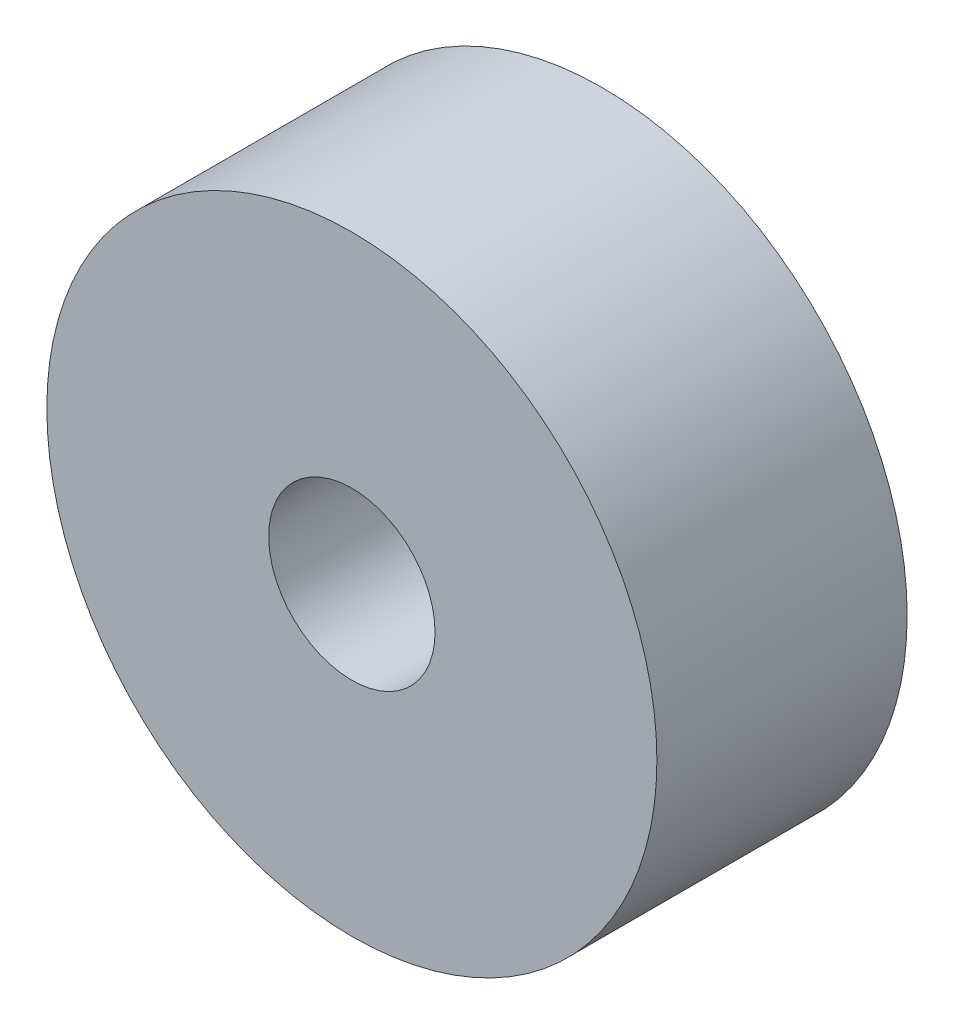
ISO-10303-21;
HEADER;
FILE_DESCRIPTION(('STEP AP214'),'2;1');
FILE_NAME('part.step','',(''),(''),'','','');
FILE_SCHEMA(('AUTOMOTIVE_DESIGN { 1 0 10303 214 1 1 1 1 }'));
ENDSEC;
DATA;
#1=APPLICATION_CONTEXT('core data for automotive mechanical design processes');
#2=APPLICATION_PROTOCOL_DEFINITION('international standard','automotive_design',2000,#1);
#3=PRODUCT_CONTEXT('',#1,'mechanical');
#4=PRODUCT('Part','Part','',(#3));
#5=PRODUCT_RELATED_PRODUCT_CATEGORY('part','',(#4));
#6=PRODUCT_DEFINITION_FORMATION('','',#4);
#7=PRODUCT_DEFINITION_CONTEXT('part definition',#1,'design');
#8=PRODUCT_DEFINITION('design','',#6,#7);
#9=PRODUCT_DEFINITION_SHAPE('','',#8);
#10=(LENGTH_UNIT() NAMED_UNIT(*) SI_UNIT(.MILLI.,.METRE.));
#11=(NAMED_UNIT(*) PLANE_ANGLE_UNIT() SI_UNIT($,.RADIAN.));
#12=(NAMED_UNIT(*) SI_UNIT($,.STERADIAN.) SOLID_ANGLE_UNIT());
#13=UNCERTAINTY_MEASURE_WITH_UNIT(LENGTH_MEASURE(1.E-05),#10,'distance_accuracy_value','');
#14=(GEOMETRIC_REPRESENTATION_CONTEXT(3) GLOBAL_UNCERTAINTY_ASSIGNED_CONTEXT((#13)) GLOBAL_UNIT_ASSIGNED_CONTEXT((#10,
#11,#12)) REPRESENTATION_CONTEXT('',''));
#15=CARTESIAN_POINT('',(0.,0.,0.));
#16=DIRECTION('',(0.,0.,1.));
#17=DIRECTION('',(1.,0.,0.));
#18=AXIS2_PLACEMENT_3D('',#15,#16,#17);
#19=CARTESIAN_POINT('',(0.,0.,0.));
#20=DIRECTION('',(0.,0.,1.));
#21=DIRECTION('',(1.,0.,0.));
#22=AXIS2_PLACEMENT_3D('',#19,#20,#21);
#23=PLANE('',#22);
#24=CARTESIAN_POINT('',(0.,0.,0.));
#25=DIRECTION('',(0.,0.,1.));
#26=DIRECTION('',(1.,0.,0.));
#27=AXIS2_PLACEMENT_3D('',#24,#25,#26);
#28=CIRCLE('',#27,22.);
#29=CARTESIAN_POINT('',(22.,0.,0.));
#30=VERTEX_POINT('',#29);
#31=EDGE_CURVE('E39',#30,#30,#28,.T.);
#32=ORIENTED_EDGE('',*,*,#31,.F.);
#33=EDGE_LOOP('',(#32));
#34=FACE_BOUND('',#33,.T.);
#35=CARTESIAN_POINT('',(0.,0.,0.));
#36=DIRECTION('',(0.,0.,1.));
#37=DIRECTION('',(1.,0.,0.));
#38=AXIS2_PLACEMENT_3D('',#35,#36,#37);
#39=CIRCLE('',#38,7.9);
#40=CARTESIAN_POINT('',(7.9,0.,0.));
#41=VERTEX_POINT('',#40);
#42=EDGE_CURVE('E43',#41,#41,#39,.T.);
#43=ORIENTED_EDGE('',*,*,#42,.T.);
#44=EDGE_LOOP('',(#43));
#45=FACE_BOUND('',#44,.T.);
#46=ADVANCED_FACE('F32',(#34,#45),#23,.F.);
#47=CARTESIAN_POINT('',(0.,0.,71.2753967444162));
#48=DIRECTION('',(0.,0.,-1.));
#49=DIRECTION('',(-1.,0.,0.));
#50=AXIS2_PLACEMENT_3D('',#47,#48,#49);
#51=CYLINDRICAL_SURFACE('',#50,22.);
#52=ORIENTED_EDGE('',*,*,#31,.T.);
#53=EDGE_LOOP('',(#52));
#54=FACE_BOUND('',#53,.T.);
#55=CARTESIAN_POINT('',(0.,0.,18.05));
#56=DIRECTION('',(0.,0.,1.));
#57=DIRECTION('',(1.,0.,0.));
#58=AXIS2_PLACEMENT_3D('',#55,#56,#57);
#59=CIRCLE('',#58,22.);
#60=CARTESIAN_POINT('',(22.,0.,18.05));
#61=VERTEX_POINT('',#60);
#62=EDGE_CURVE('E48',#61,#61,#59,.T.);
#63=ORIENTED_EDGE('',*,*,#62,.F.);
#64=EDGE_LOOP('',(#63));
#65=FACE_BOUND('',#64,.T.);
#66=ADVANCED_FACE('F61',(#54,#65),#51,.T.);
#67=CARTESIAN_POINT('',(0.,0.,71.2753967444162));
#68=DIRECTION('',(0.,0.,-1.));
#69=DIRECTION('',(-1.,0.,0.));
#70=AXIS2_PLACEMENT_3D('',#67,#68,#69);
#71=CYLINDRICAL_SURFACE('',#70,7.9);
#72=CARTESIAN_POINT('',(0.,0.,9.04999999999997));
#73=DIRECTION('',(0.,0.,-1.));
#74=DIRECTION('',(-1.,0.,0.));
#75=AXIS2_PLACEMENT_3D('',#72,#73,#74);
#76=CIRCLE('',#75,7.9);
#77=CARTESIAN_POINT('',(-7.9,0.,9.04999999999997));
#78=VERTEX_POINT('',#77);
#79=EDGE_CURVE('E10',#78,#78,#76,.T.);
#80=ORIENTED_EDGE('',*,*,#79,.F.);
#81=EDGE_LOOP('',(#80));
#82=FACE_BOUND('',#81,.T.);
#83=ORIENTED_EDGE('',*,*,#42,.F.);
#84=EDGE_LOOP('',(#83));
#85=FACE_BOUND('',#84,.T.);
#86=ADVANCED_FACE('F34',(#82,#85),#71,.F.);
#87=CARTESIAN_POINT('',(0.,0.,9.04999999999997));
#88=DIRECTION('',(0.,0.,1.));
#89=DIRECTION('',(1.,0.,0.));
#90=AXIS2_PLACEMENT_3D('',#87,#88,#89);
#91=PLANE('',#90);
#92=CARTESIAN_POINT('',(-0.000227029185990883,0.00015028358338161,9.04999999999997));
#93=DIRECTION('',(0.,0.,1.));
#94=DIRECTION('',(1.,0.,0.));
#95=AXIS2_PLACEMENT_3D('',#92,#93,#94);
#96=CIRCLE('',#95,6.);
#97=CARTESIAN_POINT('',(5.99977297081401,0.00015028358338161,9.04999999999997));
#98=VERTEX_POINT('',#97);
#99=EDGE_CURVE('E53',#98,#98,#96,.T.);
#100=ORIENTED_EDGE('',*,*,#99,.T.);
#101=EDGE_LOOP('',(#100));
#102=FACE_BOUND('',#101,.T.);
#103=ORIENTED_EDGE('',*,*,#79,.T.);
#104=EDGE_LOOP('',(#103));
#105=FACE_BOUND('',#104,.T.);
#106=ADVANCED_FACE('F67',(#102,#105),#91,.F.);
#107=CARTESIAN_POINT('',(-0.000227029185990883,0.00015028358338161,81.2753967444162));
#108=DIRECTION('',(0.,0.,-1.));
#109=DIRECTION('',(-1.,0.,0.));
#110=AXIS2_PLACEMENT_3D('',#107,#108,#109);
#111=CYLINDRICAL_SURFACE('',#110,6.);
#112=ORIENTED_EDGE('',*,*,#99,.F.);
#113=EDGE_LOOP('',(#112));
#114=FACE_BOUND('',#113,.T.);
#115=CARTESIAN_POINT('',(-0.000227029185990883,0.00015028358338161,18.05));
#116=DIRECTION('',(0.,0.,1.));
#117=DIRECTION('',(1.,0.,0.));
#118=AXIS2_PLACEMENT_3D('',#115,#116,#117);
#119=CIRCLE('',#118,6.);
#120=CARTESIAN_POINT('',(5.99977297081401,0.00015028358338161,18.05));
#121=VERTEX_POINT('',#120);
#122=EDGE_CURVE('E50',#121,#121,#119,.T.);
#123=ORIENTED_EDGE('',*,*,#122,.T.);
#124=EDGE_LOOP('',(#123));
#125=FACE_BOUND('',#124,.T.);
#126=ADVANCED_FACE('F74',(#114,#125),#111,.F.);
#127=CARTESIAN_POINT('',(7.20613970958815,10.8199598210147,18.05));
#128=DIRECTION('',(0.,0.,1.));
#129=DIRECTION('',(0.83229304134087,-0.554335902982626,0.));
#130=AXIS2_PLACEMENT_3D('',#127,#128,#129);
#131=PLANE('',#130);
#132=ORIENTED_EDGE('',*,*,#122,.F.);
#133=EDGE_LOOP('',(#132));
#134=FACE_BOUND('',#133,.T.);
#135=ORIENTED_EDGE('',*,*,#62,.T.);
#136=EDGE_LOOP('',(#135));
#137=FACE_BOUND('',#136,.T.);
#138=ADVANCED_FACE('F59',(#134,#137),#131,.T.);
#139=CLOSED_SHELL('',(#46,#66,#86,#106,#126,#138));
#140=MANIFOLD_SOLID_BREP('B2',#139);
#141=ADVANCED_BREP_SHAPE_REPRESENTATION('',(#18,#140),#14);
#142=SHAPE_DEFINITION_REPRESENTATION(#9,#141);
ENDSEC;
END-ISO-10303-21;
